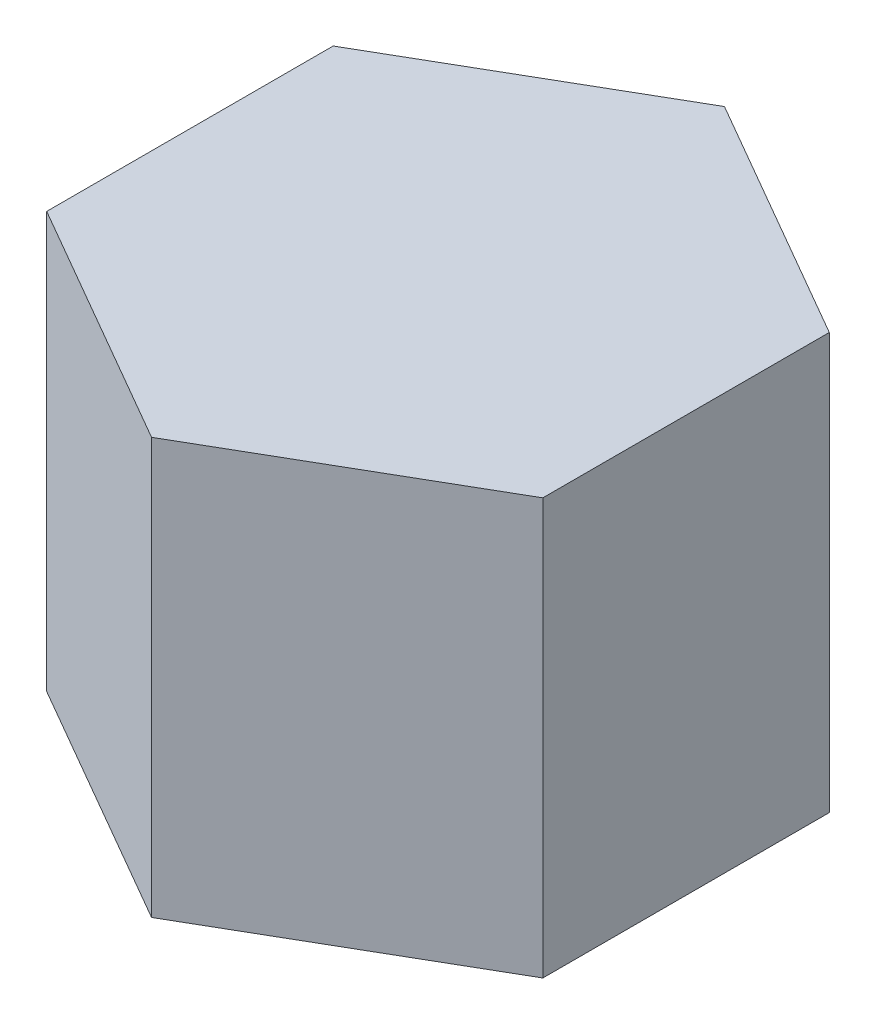
ISO-10303-21;
HEADER;
FILE_DESCRIPTION(('STEP AP214'),'2;1');
FILE_NAME('part.step','',(''),(''),'','','');
FILE_SCHEMA(('AUTOMOTIVE_DESIGN { 1 0 10303 214 1 1 1 1 }'));
ENDSEC;
DATA;
#1=APPLICATION_CONTEXT('core data for automotive mechanical design processes');
#2=APPLICATION_PROTOCOL_DEFINITION('international standard','automotive_design',2000,#1);
#3=PRODUCT_CONTEXT('',#1,'mechanical');
#4=PRODUCT('Part','Part','',(#3));
#5=PRODUCT_RELATED_PRODUCT_CATEGORY('part','',(#4));
#6=PRODUCT_DEFINITION_FORMATION('','',#4);
#7=PRODUCT_DEFINITION_CONTEXT('part definition',#1,'design');
#8=PRODUCT_DEFINITION('design','',#6,#7);
#9=PRODUCT_DEFINITION_SHAPE('','',#8);
#10=(LENGTH_UNIT() NAMED_UNIT(*) SI_UNIT(.MILLI.,.METRE.));
#11=(NAMED_UNIT(*) PLANE_ANGLE_UNIT() SI_UNIT($,.RADIAN.));
#12=(NAMED_UNIT(*) SI_UNIT($,.STERADIAN.) SOLID_ANGLE_UNIT());
#13=UNCERTAINTY_MEASURE_WITH_UNIT(LENGTH_MEASURE(1.E-05),#10,'distance_accuracy_value','');
#14=(GEOMETRIC_REPRESENTATION_CONTEXT(3) GLOBAL_UNCERTAINTY_ASSIGNED_CONTEXT((#13)) GLOBAL_UNIT_ASSIGNED_CONTEXT((#10,
#11,#12)) REPRESENTATION_CONTEXT('',''));
#15=CARTESIAN_POINT('',(0.,0.,0.));
#16=DIRECTION('',(0.,0.,1.));
#17=DIRECTION('',(1.,0.,0.));
#18=AXIS2_PLACEMENT_3D('',#15,#16,#17);
#19=CARTESIAN_POINT('',(203.142660308706,-148.537700895744,290.64094581671));
#20=DIRECTION('',(-0.499999999999909,0.,-0.866025403784491));
#21=DIRECTION('',(-0.866025403784491,0.,0.499999999999909));
#22=AXIS2_PLACEMENT_3D('',#19,#20,#21);
#23=PLANE('',#22);
#24=CARTESIAN_POINT('',(202.839551417382,-149.045793579175,290.81594581671));
#25=DIRECTION('',(0.866025403784491,0.,-0.499999999999909));
#26=VECTOR('',#25,1.);
#27=LINE('',#24,#26);
#28=CARTESIAN_POINT('',(202.839551417382,-149.045793579175,290.81594581671));
#29=VERTEX_POINT('',#28);
#30=CARTESIAN_POINT('',(203.142660308706,-149.045793579175,290.64094581671));
#31=VERTEX_POINT('',#30);
#32=EDGE_CURVE('E170',#29,#31,#27,.T.);
#33=ORIENTED_EDGE('',*,*,#32,.T.);
#34=CARTESIAN_POINT('',(203.142660308706,-148.537700895744,290.64094581671));
#35=DIRECTION('',(0.,-1.,0.));
#36=VECTOR('',#35,1.);
#37=LINE('',#34,#36);
#38=CARTESIAN_POINT('',(203.142660308706,-148.537700895744,290.64094581671));
#39=VERTEX_POINT('',#38);
#40=EDGE_CURVE('E35',#39,#31,#37,.T.);
#41=ORIENTED_EDGE('',*,*,#40,.F.);
#42=CARTESIAN_POINT('',(202.839551417382,-148.537700895744,290.81594581671));
#43=DIRECTION('',(0.866025403784491,0.,-0.499999999999909));
#44=VECTOR('',#43,1.);
#45=LINE('',#42,#44);
#46=CARTESIAN_POINT('',(202.839551417382,-148.537700895744,290.81594581671));
#47=VERTEX_POINT('',#46);
#48=EDGE_CURVE('E159',#47,#39,#45,.T.);
#49=ORIENTED_EDGE('',*,*,#48,.F.);
#50=CARTESIAN_POINT('',(202.839551417382,-148.537700895744,290.81594581671));
#51=DIRECTION('',(0.,-1.,0.));
#52=VECTOR('',#51,1.);
#53=LINE('',#50,#52);
#54=EDGE_CURVE('E10',#47,#29,#53,.T.);
#55=ORIENTED_EDGE('',*,*,#54,.T.);
#56=EDGE_LOOP('',(#33,#41,#49,#55));
#57=FACE_BOUND('',#56,.T.);
#58=ADVANCED_FACE('F16',(#57),#23,.F.);
#59=CARTESIAN_POINT('',(202.839551417382,-148.537700895744,290.81594581671));
#60=DIRECTION('',(0.500000000000062,0.,-0.866025403784403));
#61=DIRECTION('',(-0.866025403784403,0.,-0.500000000000062));
#62=AXIS2_PLACEMENT_3D('',#59,#60,#61);
#63=PLANE('',#62);
#64=CARTESIAN_POINT('',(202.536442526057,-149.045793579175,290.64094581671));
#65=DIRECTION('',(0.866025403784403,0.,0.500000000000062));
#66=VECTOR('',#65,1.);
#67=LINE('',#64,#66);
#68=CARTESIAN_POINT('',(202.536442526057,-149.045793579175,290.64094581671));
#69=VERTEX_POINT('',#68);
#70=EDGE_CURVE('E167',#69,#29,#67,.T.);
#71=ORIENTED_EDGE('',*,*,#70,.T.);
#72=ORIENTED_EDGE('',*,*,#54,.F.);
#73=CARTESIAN_POINT('',(202.536442526057,-148.537700895744,290.64094581671));
#74=DIRECTION('',(0.866025403784403,0.,0.500000000000062));
#75=VECTOR('',#74,1.);
#76=LINE('',#73,#75);
#77=CARTESIAN_POINT('',(202.536442526057,-148.537700895744,290.64094581671));
#78=VERTEX_POINT('',#77);
#79=EDGE_CURVE('E156',#78,#47,#76,.T.);
#80=ORIENTED_EDGE('',*,*,#79,.F.);
#81=CARTESIAN_POINT('',(202.536442526057,-148.537700895744,290.64094581671));
#82=DIRECTION('',(0.,-1.,0.));
#83=VECTOR('',#82,1.);
#84=LINE('',#81,#83);
#85=EDGE_CURVE('E27',#78,#69,#84,.T.);
#86=ORIENTED_EDGE('',*,*,#85,.T.);
#87=EDGE_LOOP('',(#71,#72,#80,#86));
#88=FACE_BOUND('',#87,.T.);
#89=ADVANCED_FACE('F189',(#88),#63,.F.);
#90=CARTESIAN_POINT('',(202.536442526057,-148.537700895744,290.831971220494));
#91=DIRECTION('',(1.,0.,0.));
#92=DIRECTION('',(0.,1.,0.));
#93=AXIS2_PLACEMENT_3D('',#90,#91,#92);
#94=PLANE('',#93);
#95=CARTESIAN_POINT('',(202.536442526057,-149.045793579175,290.29094581671));
#96=DIRECTION('',(0.,0.,1.));
#97=VECTOR('',#96,1.);
#98=LINE('',#95,#97);
#99=CARTESIAN_POINT('',(202.536442526057,-149.045793579175,290.29094581671));
#100=VERTEX_POINT('',#99);
#101=EDGE_CURVE('E163',#100,#69,#98,.T.);
#102=ORIENTED_EDGE('',*,*,#101,.T.);
#103=ORIENTED_EDGE('',*,*,#85,.F.);
#104=CARTESIAN_POINT('',(202.536442526057,-148.537700895744,290.29094581671));
#105=DIRECTION('',(0.,0.,1.));
#106=VECTOR('',#105,1.);
#107=LINE('',#104,#106);
#108=CARTESIAN_POINT('',(202.536442526057,-148.537700895744,290.29094581671));
#109=VERTEX_POINT('',#108);
#110=EDGE_CURVE('E106',#109,#78,#107,.T.);
#111=ORIENTED_EDGE('',*,*,#110,.F.);
#112=CARTESIAN_POINT('',(202.536442526057,-148.537700895744,290.29094581671));
#113=DIRECTION('',(0.,-1.,0.));
#114=VECTOR('',#113,1.);
#115=LINE('',#112,#114);
#116=EDGE_CURVE('E94',#109,#100,#115,.T.);
#117=ORIENTED_EDGE('',*,*,#116,.T.);
#118=EDGE_LOOP('',(#102,#103,#111,#117));
#119=FACE_BOUND('',#118,.T.);
#120=ADVANCED_FACE('F198',(#119),#94,.F.);
#121=CARTESIAN_POINT('',(202.536442526057,-148.537700895744,290.29094581671));
#122=DIRECTION('',(0.499999999999943,0.,0.866025403784472));
#123=DIRECTION('',(0.866025403784472,0.,-0.499999999999943));
#124=AXIS2_PLACEMENT_3D('',#121,#122,#123);
#125=PLANE('',#124);
#126=CARTESIAN_POINT('',(202.839551417382,-149.045793579175,290.11594581671));
#127=DIRECTION('',(-0.866025403784471,0.,0.499999999999943));
#128=VECTOR('',#127,1.);
#129=LINE('',#126,#128);
#130=CARTESIAN_POINT('',(202.839551417382,-149.045793579175,290.11594581671));
#131=VERTEX_POINT('',#130);
#132=EDGE_CURVE('E162',#131,#100,#129,.T.);
#133=ORIENTED_EDGE('',*,*,#132,.T.);
#134=ORIENTED_EDGE('',*,*,#116,.F.);
#135=CARTESIAN_POINT('',(202.839551417382,-148.537700895744,290.11594581671));
#136=DIRECTION('',(-0.866025403784471,0.,0.499999999999943));
#137=VECTOR('',#136,1.);
#138=LINE('',#135,#137);
#139=CARTESIAN_POINT('',(202.839551417382,-148.537700895744,290.11594581671));
#140=VERTEX_POINT('',#139);
#141=EDGE_CURVE('E98',#140,#109,#138,.T.);
#142=ORIENTED_EDGE('',*,*,#141,.F.);
#143=CARTESIAN_POINT('',(202.839551417382,-148.537700895744,290.11594581671));
#144=DIRECTION('',(0.,-1.,0.));
#145=VECTOR('',#144,1.);
#146=LINE('',#143,#145);
#147=EDGE_CURVE('E79',#140,#131,#146,.T.);
#148=ORIENTED_EDGE('',*,*,#147,.T.);
#149=EDGE_LOOP('',(#133,#134,#142,#148));
#150=FACE_BOUND('',#149,.T.);
#151=ADVANCED_FACE('F100',(#150),#125,.F.);
#152=CARTESIAN_POINT('',(202.839551417381,-148.537700895744,290.11594581671));
#153=DIRECTION('',(-0.500000000000062,0.,0.866025403784403));
#154=DIRECTION('',(0.866025403784403,0.,0.500000000000062));
#155=AXIS2_PLACEMENT_3D('',#152,#153,#154);
#156=PLANE('',#155);
#157=CARTESIAN_POINT('',(203.142660308706,-149.045793579175,290.29094581671));
#158=DIRECTION('',(-0.866025403784403,0.,-0.500000000000062));
#159=VECTOR('',#158,1.);
#160=LINE('',#157,#159);
#161=CARTESIAN_POINT('',(203.142660308706,-149.045793579175,290.29094581671));
#162=VERTEX_POINT('',#161);
#163=EDGE_CURVE('E88',#162,#131,#160,.T.);
#164=ORIENTED_EDGE('',*,*,#163,.T.);
#165=ORIENTED_EDGE('',*,*,#147,.F.);
#166=CARTESIAN_POINT('',(203.142660308706,-148.537700895744,290.29094581671));
#167=DIRECTION('',(-0.866025403784403,0.,-0.500000000000062));
#168=VECTOR('',#167,1.);
#169=LINE('',#166,#168);
#170=CARTESIAN_POINT('',(203.142660308706,-148.537700895744,290.29094581671));
#171=VERTEX_POINT('',#170);
#172=EDGE_CURVE('E84',#171,#140,#169,.T.);
#173=ORIENTED_EDGE('',*,*,#172,.F.);
#174=CARTESIAN_POINT('',(203.142660308706,-148.537700895744,290.29094581671));
#175=DIRECTION('',(0.,-1.,0.));
#176=VECTOR('',#175,1.);
#177=LINE('',#174,#176);
#178=EDGE_CURVE('E58',#171,#162,#177,.T.);
#179=ORIENTED_EDGE('',*,*,#178,.T.);
#180=EDGE_LOOP('',(#164,#165,#173,#179));
#181=FACE_BOUND('',#180,.T.);
#182=ADVANCED_FACE('F82',(#181),#156,.F.);
#183=CARTESIAN_POINT('',(203.142660308706,-148.537700895744,290.831971220494));
#184=DIRECTION('',(-1.,0.,0.));
#185=DIRECTION('',(0.,-1.,0.));
#186=AXIS2_PLACEMENT_3D('',#183,#184,#185);
#187=PLANE('',#186);
#188=CARTESIAN_POINT('',(203.142660308706,-149.045793579175,290.64094581671));
#189=DIRECTION('',(0.,0.,-1.));
#190=VECTOR('',#189,1.);
#191=LINE('',#188,#190);
#192=EDGE_CURVE('E160',#31,#162,#191,.T.);
#193=ORIENTED_EDGE('',*,*,#192,.T.);
#194=ORIENTED_EDGE('',*,*,#178,.F.);
#195=CARTESIAN_POINT('',(203.142660308706,-148.537700895744,290.64094581671));
#196=DIRECTION('',(0.,0.,-1.));
#197=VECTOR('',#196,1.);
#198=LINE('',#195,#197);
#199=EDGE_CURVE('E112',#39,#171,#198,.T.);
#200=ORIENTED_EDGE('',*,*,#199,.F.);
#201=ORIENTED_EDGE('',*,*,#40,.T.);
#202=EDGE_LOOP('',(#193,#194,#200,#201));
#203=FACE_BOUND('',#202,.T.);
#204=ADVANCED_FACE('F131',(#203),#187,.F.);
#205=CARTESIAN_POINT('',(206.339551417382,-148.537700895744,290.831971220494));
#206=DIRECTION('',(0.,-1.,0.));
#207=DIRECTION('',(1.,0.,0.));
#208=AXIS2_PLACEMENT_3D('',#205,#206,#207);
#209=PLANE('',#208);
#210=ORIENTED_EDGE('',*,*,#48,.T.);
#211=ORIENTED_EDGE('',*,*,#199,.T.);
#212=ORIENTED_EDGE('',*,*,#172,.T.);
#213=ORIENTED_EDGE('',*,*,#141,.T.);
#214=ORIENTED_EDGE('',*,*,#110,.T.);
#215=ORIENTED_EDGE('',*,*,#79,.T.);
#216=EDGE_LOOP('',(#210,#211,#212,#213,#214,#215));
#217=FACE_BOUND('',#216,.T.);
#218=ADVANCED_FACE('F111',(#217),#209,.F.);
#219=CARTESIAN_POINT('',(206.339551417382,-149.045793579175,290.831971220494));
#220=DIRECTION('',(0.,-1.,0.));
#221=DIRECTION('',(1.,0.,0.));
#222=AXIS2_PLACEMENT_3D('',#219,#220,#221);
#223=PLANE('',#222);
#224=ORIENTED_EDGE('',*,*,#32,.F.);
#225=ORIENTED_EDGE('',*,*,#70,.F.);
#226=ORIENTED_EDGE('',*,*,#101,.F.);
#227=ORIENTED_EDGE('',*,*,#132,.F.);
#228=ORIENTED_EDGE('',*,*,#163,.F.);
#229=ORIENTED_EDGE('',*,*,#192,.F.);
#230=EDGE_LOOP('',(#224,#225,#226,#227,#228,#229));
#231=FACE_BOUND('',#230,.T.);
#232=ADVANCED_FACE('F130',(#231),#223,.T.);
#233=CLOSED_SHELL('',(#58,#89,#120,#151,#182,#204,#218,#232));
#234=MANIFOLD_SOLID_BREP('B1',#233);
#235=ADVANCED_BREP_SHAPE_REPRESENTATION('',(#18,#234),#14);
#236=SHAPE_DEFINITION_REPRESENTATION(#9,#235);
ENDSEC;
END-ISO-10303-21;
